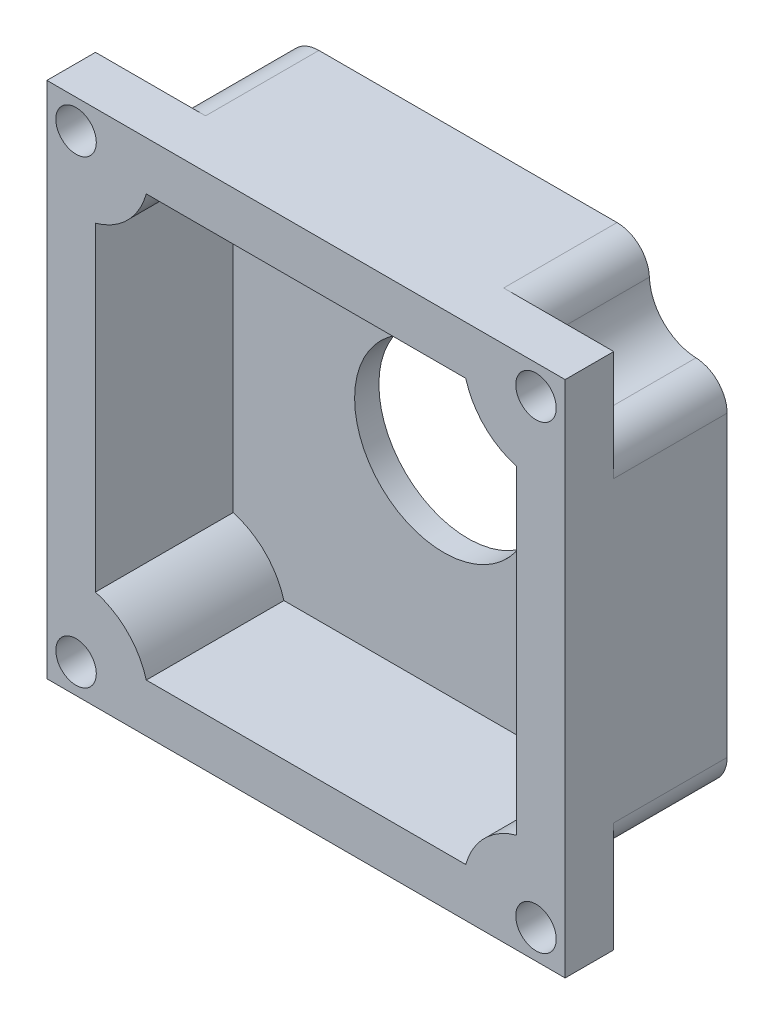
ISO-10303-21;
HEADER;
FILE_DESCRIPTION(('STEP AP214'),'2;1');
FILE_NAME('part.step','',(''),(''),'','','');
FILE_SCHEMA(('AUTOMOTIVE_DESIGN { 1 0 10303 214 1 1 1 1 }'));
ENDSEC;
DATA;
#1=APPLICATION_CONTEXT('core data for automotive mechanical design processes');
#2=APPLICATION_PROTOCOL_DEFINITION('international standard','automotive_design',2000,#1);
#3=PRODUCT_CONTEXT('',#1,'mechanical');
#4=PRODUCT('Part','Part','',(#3));
#5=PRODUCT_RELATED_PRODUCT_CATEGORY('part','',(#4));
#6=PRODUCT_DEFINITION_FORMATION('','',#4);
#7=PRODUCT_DEFINITION_CONTEXT('part definition',#1,'design');
#8=PRODUCT_DEFINITION('design','',#6,#7);
#9=PRODUCT_DEFINITION_SHAPE('','',#8);
#10=(LENGTH_UNIT() NAMED_UNIT(*) SI_UNIT(.MILLI.,.METRE.));
#11=(NAMED_UNIT(*) PLANE_ANGLE_UNIT() SI_UNIT($,.RADIAN.));
#12=(NAMED_UNIT(*) SI_UNIT($,.STERADIAN.) SOLID_ANGLE_UNIT());
#13=UNCERTAINTY_MEASURE_WITH_UNIT(LENGTH_MEASURE(1.E-05),#10,'distance_accuracy_value','');
#14=(GEOMETRIC_REPRESENTATION_CONTEXT(3) GLOBAL_UNCERTAINTY_ASSIGNED_CONTEXT((#13)) GLOBAL_UNIT_ASSIGNED_CONTEXT((#10,
#11,#12)) REPRESENTATION_CONTEXT('',''));
#15=CARTESIAN_POINT('',(0.,0.,0.));
#16=DIRECTION('',(0.,0.,1.));
#17=DIRECTION('',(1.,0.,0.));
#18=AXIS2_PLACEMENT_3D('',#15,#16,#17);
#19=CARTESIAN_POINT('',(0.,0.,1.5));
#20=DIRECTION('',(0.,0.,-1.));
#21=DIRECTION('',(-1.,0.,0.));
#22=AXIS2_PLACEMENT_3D('',#19,#20,#21);
#23=PLANE('',#22);
#24=CARTESIAN_POINT('',(0.,0.,1.5));
#25=DIRECTION('',(0.,0.,-1.));
#26=DIRECTION('',(-1.,0.,0.));
#27=AXIS2_PLACEMENT_3D('',#24,#25,#26);
#28=CIRCLE('',#27,5.5);
#29=CARTESIAN_POINT('',(-5.5,0.,1.5));
#30=VERTEX_POINT('',#29);
#31=EDGE_CURVE('E272',#30,#30,#28,.T.);
#32=ORIENTED_EDGE('',*,*,#31,.T.);
#33=EDGE_LOOP('',(#32));
#34=FACE_BOUND('',#33,.T.);
#35=CARTESIAN_POINT('',(-14.2000000000002,-14.1999999999999,1.5));
#36=DIRECTION('',(0.,0.,1.));
#37=DIRECTION('',(0.,1.,0.));
#38=AXIS2_PLACEMENT_3D('',#35,#36,#37);
#39=CIRCLE('',#38,4.5);
#40=CARTESIAN_POINT('',(-9.86295031155985,-13.,1.5));
#41=VERTEX_POINT('',#40);
#42=CARTESIAN_POINT('',(-13.,-9.86295031155958,1.5));
#43=VERTEX_POINT('',#42);
#44=EDGE_CURVE('E580',#41,#43,#39,.T.);
#45=ORIENTED_EDGE('',*,*,#44,.F.);
#46=DIRECTION('',(-1.,0.,0.));
#47=VECTOR('',#46,1.);
#48=CARTESIAN_POINT('',(13.,-13.,1.5));
#49=LINE('',#48,#47);
#50=CARTESIAN_POINT('',(9.86295031155971,-13.,1.5));
#51=VERTEX_POINT('',#50);
#52=EDGE_CURVE('E465',#51,#41,#49,.T.);
#53=ORIENTED_EDGE('',*,*,#52,.F.);
#54=CARTESIAN_POINT('',(14.2,-14.2,1.5));
#55=DIRECTION('',(0.,0.,1.));
#56=DIRECTION('',(-1.,0.,0.));
#57=AXIS2_PLACEMENT_3D('',#54,#55,#56);
#58=CIRCLE('',#57,4.5);
#59=CARTESIAN_POINT('',(13.,-9.86295031155971,1.5));
#60=VERTEX_POINT('',#59);
#61=EDGE_CURVE('E565',#60,#51,#58,.T.);
#62=ORIENTED_EDGE('',*,*,#61,.F.);
#63=DIRECTION('',(0.,-1.,0.));
#64=VECTOR('',#63,1.);
#65=CARTESIAN_POINT('',(13.,13.,1.5));
#66=LINE('',#65,#64);
#67=CARTESIAN_POINT('',(13.,9.86295031155967,1.5));
#68=VERTEX_POINT('',#67);
#69=EDGE_CURVE('E276',#68,#60,#66,.T.);
#70=ORIENTED_EDGE('',*,*,#69,.F.);
#71=CARTESIAN_POINT('',(14.2000000000001,14.2,1.5));
#72=DIRECTION('',(0.,0.,1.));
#73=DIRECTION('',(0.,-1.,0.));
#74=AXIS2_PLACEMENT_3D('',#71,#72,#73);
#75=CIRCLE('',#74,4.5);
#76=CARTESIAN_POINT('',(9.86295031155975,13.,1.5));
#77=VERTEX_POINT('',#76);
#78=EDGE_CURVE('E550',#77,#68,#75,.T.);
#79=ORIENTED_EDGE('',*,*,#78,.F.);
#80=DIRECTION('',(1.,0.,0.));
#81=VECTOR('',#80,1.);
#82=CARTESIAN_POINT('',(13.,13.,1.5));
#83=LINE('',#82,#81);
#84=CARTESIAN_POINT('',(-9.86295031155971,13.,1.5));
#85=VERTEX_POINT('',#84);
#86=EDGE_CURVE('E458',#85,#77,#83,.T.);
#87=ORIENTED_EDGE('',*,*,#86,.F.);
#88=CARTESIAN_POINT('',(-14.2,14.2,1.5));
#89=DIRECTION('',(0.,0.,1.));
#90=DIRECTION('',(1.,0.,0.));
#91=AXIS2_PLACEMENT_3D('',#88,#89,#90);
#92=CIRCLE('',#91,4.5);
#93=CARTESIAN_POINT('',(-13.,9.86295031155971,1.5));
#94=VERTEX_POINT('',#93);
#95=EDGE_CURVE('E535',#94,#85,#92,.T.);
#96=ORIENTED_EDGE('',*,*,#95,.F.);
#97=DIRECTION('',(0.,1.,0.));
#98=VECTOR('',#97,1.);
#99=CARTESIAN_POINT('',(-13.,13.,1.5));
#100=LINE('',#99,#98);
#101=EDGE_CURVE('E462',#43,#94,#100,.T.);
#102=ORIENTED_EDGE('',*,*,#101,.F.);
#103=EDGE_LOOP('',(#45,#53,#62,#70,#79,#87,#96,#102));
#104=FACE_BOUND('',#103,.T.);
#105=ADVANCED_FACE('F41',(#34,#104),#23,.F.);
#106=CARTESIAN_POINT('',(13.,-13.,10.));
#107=DIRECTION('',(0.,1.,0.));
#108=DIRECTION('',(-1.,0.,0.));
#109=AXIS2_PLACEMENT_3D('',#106,#107,#108);
#110=PLANE('',#109);
#111=ORIENTED_EDGE('',*,*,#52,.T.);
#112=DIRECTION('',(0.,0.,-1.));
#113=VECTOR('',#112,1.);
#114=CARTESIAN_POINT('',(-9.86295031155985,-12.9999999999999,10.));
#115=LINE('',#114,#113);
#116=CARTESIAN_POINT('',(-9.86295031155982,-13.,10.));
#117=VERTEX_POINT('',#116);
#118=EDGE_CURVE('E569',#117,#41,#115,.T.);
#119=ORIENTED_EDGE('',*,*,#118,.F.);
#120=DIRECTION('',(1.,0.,0.));
#121=VECTOR('',#120,1.);
#122=CARTESIAN_POINT('',(13.,-13.,10.));
#123=LINE('',#122,#121);
#124=CARTESIAN_POINT('',(9.86295031155971,-13.,10.));
#125=VERTEX_POINT('',#124);
#126=EDGE_CURVE('E455',#117,#125,#123,.T.);
#127=ORIENTED_EDGE('',*,*,#126,.T.);
#128=DIRECTION('',(0.,0.,-1.));
#129=VECTOR('',#128,1.);
#130=CARTESIAN_POINT('',(9.86295031155971,-13.,10.));
#131=LINE('',#130,#129);
#132=EDGE_CURVE('E561',#125,#51,#131,.T.);
#133=ORIENTED_EDGE('',*,*,#132,.T.);
#134=EDGE_LOOP('',(#111,#119,#127,#133));
#135=FACE_BOUND('',#134,.T.);
#136=ADVANCED_FACE('F620',(#135),#110,.T.);
#137=CARTESIAN_POINT('',(-13.,-13.,10.));
#138=DIRECTION('',(1.,0.,0.));
#139=DIRECTION('',(0.,0.,-1.));
#140=AXIS2_PLACEMENT_3D('',#137,#138,#139);
#141=PLANE('',#140);
#142=DIRECTION('',(0.,-1.,0.));
#143=VECTOR('',#142,1.);
#144=CARTESIAN_POINT('',(-13.,-13.,10.));
#145=LINE('',#144,#143);
#146=CARTESIAN_POINT('',(-13.,9.86295031155971,10.));
#147=VERTEX_POINT('',#146);
#148=CARTESIAN_POINT('',(-13.,-9.86295031155958,10.));
#149=VERTEX_POINT('',#148);
#150=EDGE_CURVE('E423',#147,#149,#145,.T.);
#151=ORIENTED_EDGE('',*,*,#150,.T.);
#152=DIRECTION('',(0.,0.,-1.));
#153=VECTOR('',#152,1.);
#154=CARTESIAN_POINT('',(-13.0000000000001,-9.86295031155958,10.));
#155=LINE('',#154,#153);
#156=EDGE_CURVE('E576',#149,#43,#155,.T.);
#157=ORIENTED_EDGE('',*,*,#156,.T.);
#158=ORIENTED_EDGE('',*,*,#101,.T.);
#159=DIRECTION('',(0.,0.,-1.));
#160=VECTOR('',#159,1.);
#161=CARTESIAN_POINT('',(-13.,9.86295031155971,10.));
#162=LINE('',#161,#160);
#163=EDGE_CURVE('E512',#147,#94,#162,.T.);
#164=ORIENTED_EDGE('',*,*,#163,.F.);
#165=EDGE_LOOP('',(#151,#157,#158,#164));
#166=FACE_BOUND('',#165,.T.);
#167=ADVANCED_FACE('F597',(#166),#141,.T.);
#168=CARTESIAN_POINT('',(13.,-13.,10.));
#169=DIRECTION('',(-1.,0.,0.));
#170=DIRECTION('',(0.,0.,1.));
#171=AXIS2_PLACEMENT_3D('',#168,#169,#170);
#172=PLANE('',#171);
#173=ORIENTED_EDGE('',*,*,#69,.T.);
#174=DIRECTION('',(0.,0.,-1.));
#175=VECTOR('',#174,1.);
#176=CARTESIAN_POINT('',(13.,-9.86295031155971,10.));
#177=LINE('',#176,#175);
#178=CARTESIAN_POINT('',(13.,-9.86295031155972,10.));
#179=VERTEX_POINT('',#178);
#180=EDGE_CURVE('E554',#179,#60,#177,.T.);
#181=ORIENTED_EDGE('',*,*,#180,.F.);
#182=DIRECTION('',(0.,1.,0.));
#183=VECTOR('',#182,1.);
#184=CARTESIAN_POINT('',(13.,-13.,10.));
#185=LINE('',#184,#183);
#186=CARTESIAN_POINT('',(13.,9.86295031155967,10.));
#187=VERTEX_POINT('',#186);
#188=EDGE_CURVE('E452',#179,#187,#185,.T.);
#189=ORIENTED_EDGE('',*,*,#188,.T.);
#190=DIRECTION('',(0.,0.,-1.));
#191=VECTOR('',#190,1.);
#192=CARTESIAN_POINT('',(13.,9.86295031155967,10.));
#193=LINE('',#192,#191);
#194=EDGE_CURVE('E546',#187,#68,#193,.T.);
#195=ORIENTED_EDGE('',*,*,#194,.T.);
#196=EDGE_LOOP('',(#173,#181,#189,#195));
#197=FACE_BOUND('',#196,.T.);
#198=ADVANCED_FACE('F614',(#197),#172,.T.);
#199=CARTESIAN_POINT('',(13.,13.,10.));
#200=DIRECTION('',(0.,-1.,0.));
#201=DIRECTION('',(1.,0.,0.));
#202=AXIS2_PLACEMENT_3D('',#199,#200,#201);
#203=PLANE('',#202);
#204=ORIENTED_EDGE('',*,*,#86,.T.);
#205=DIRECTION('',(0.,0.,-1.));
#206=VECTOR('',#205,1.);
#207=CARTESIAN_POINT('',(9.86295031155976,13.,10.));
#208=LINE('',#207,#206);
#209=CARTESIAN_POINT('',(9.86295031155975,13.,10.));
#210=VERTEX_POINT('',#209);
#211=EDGE_CURVE('E539',#210,#77,#208,.T.);
#212=ORIENTED_EDGE('',*,*,#211,.F.);
#213=DIRECTION('',(-1.,0.,0.));
#214=VECTOR('',#213,1.);
#215=CARTESIAN_POINT('',(13.,13.,10.));
#216=LINE('',#215,#214);
#217=CARTESIAN_POINT('',(-9.86295031155971,13.,10.));
#218=VERTEX_POINT('',#217);
#219=EDGE_CURVE('E449',#210,#218,#216,.T.);
#220=ORIENTED_EDGE('',*,*,#219,.T.);
#221=DIRECTION('',(0.,0.,-1.));
#222=VECTOR('',#221,1.);
#223=CARTESIAN_POINT('',(-9.86295031155971,13.,10.));
#224=LINE('',#223,#222);
#225=EDGE_CURVE('E531',#218,#85,#224,.T.);
#226=ORIENTED_EDGE('',*,*,#225,.T.);
#227=EDGE_LOOP('',(#204,#212,#220,#226));
#228=FACE_BOUND('',#227,.T.);
#229=ADVANCED_FACE('F723',(#228),#203,.T.);
#230=CARTESIAN_POINT('',(14.2,14.2,21.5));
#231=DIRECTION('',(0.,0.,-1.));
#232=DIRECTION('',(-1.,0.,0.));
#233=AXIS2_PLACEMENT_3D('',#230,#231,#232);
#234=CYLINDRICAL_SURFACE('',#233,1.25);
#235=CARTESIAN_POINT('',(14.2,14.2,10.));
#236=DIRECTION('',(0.,0.,1.));
#237=DIRECTION('',(1.,0.,0.));
#238=AXIS2_PLACEMENT_3D('',#235,#236,#237);
#239=CIRCLE('',#238,1.25);
#240=CARTESIAN_POINT('',(15.45,14.2,10.));
#241=VERTEX_POINT('',#240);
#242=EDGE_CURVE('E487',#241,#241,#239,.T.);
#243=ORIENTED_EDGE('',*,*,#242,.T.);
#244=EDGE_LOOP('',(#243));
#245=FACE_BOUND('',#244,.T.);
#246=CARTESIAN_POINT('',(14.2,14.2,7.));
#247=DIRECTION('',(0.,0.,-1.));
#248=DIRECTION('',(-1.,0.,0.));
#249=AXIS2_PLACEMENT_3D('',#246,#247,#248);
#250=CIRCLE('',#249,1.25);
#251=CARTESIAN_POINT('',(12.95,14.2,7.));
#252=VERTEX_POINT('',#251);
#253=EDGE_CURVE('E292',#252,#252,#250,.F.);
#254=ORIENTED_EDGE('',*,*,#253,.F.);
#255=EDGE_LOOP('',(#254));
#256=FACE_BOUND('',#255,.T.);
#257=ADVANCED_FACE('F721',(#245,#256),#234,.F.);
#258=CARTESIAN_POINT('',(-14.2,-14.2,21.5));
#259=DIRECTION('',(0.,0.,-1.));
#260=DIRECTION('',(-1.,0.,0.));
#261=AXIS2_PLACEMENT_3D('',#258,#259,#260);
#262=CYLINDRICAL_SURFACE('',#261,1.25);
#263=CARTESIAN_POINT('',(-14.2,-14.2,10.));
#264=DIRECTION('',(0.,0.,1.));
#265=DIRECTION('',(1.,0.,0.));
#266=AXIS2_PLACEMENT_3D('',#263,#264,#265);
#267=CIRCLE('',#266,1.25);
#268=CARTESIAN_POINT('',(-12.95,-14.2,10.));
#269=VERTEX_POINT('',#268);
#270=EDGE_CURVE('E479',#269,#269,#267,.T.);
#271=ORIENTED_EDGE('',*,*,#270,.T.);
#272=EDGE_LOOP('',(#271));
#273=FACE_BOUND('',#272,.T.);
#274=CARTESIAN_POINT('',(-14.2,-14.2,7.));
#275=DIRECTION('',(0.,0.,-1.));
#276=DIRECTION('',(-1.,0.,0.));
#277=AXIS2_PLACEMENT_3D('',#274,#275,#276);
#278=CIRCLE('',#277,1.25);
#279=CARTESIAN_POINT('',(-15.45,-14.2,7.));
#280=VERTEX_POINT('',#279);
#281=EDGE_CURVE('E253',#280,#280,#278,.F.);
#282=ORIENTED_EDGE('',*,*,#281,.F.);
#283=EDGE_LOOP('',(#282));
#284=FACE_BOUND('',#283,.T.);
#285=ADVANCED_FACE('F635',(#273,#284),#262,.F.);
#286=CARTESIAN_POINT('',(0.,0.,10.));
#287=DIRECTION('',(0.,0.,1.));
#288=DIRECTION('',(1.,0.,0.));
#289=AXIS2_PLACEMENT_3D('',#286,#287,#288);
#290=PLANE('',#289);
#291=ORIENTED_EDGE('',*,*,#126,.F.);
#292=CARTESIAN_POINT('',(-14.2000000000002,-14.1999999999999,10.));
#293=DIRECTION('',(0.,0.,1.));
#294=DIRECTION('',(0.,1.,0.));
#295=AXIS2_PLACEMENT_3D('',#292,#293,#294);
#296=CIRCLE('',#295,4.5);
#297=EDGE_CURVE('E579',#117,#149,#296,.T.);
#298=ORIENTED_EDGE('',*,*,#297,.T.);
#299=ORIENTED_EDGE('',*,*,#150,.F.);
#300=CARTESIAN_POINT('',(-14.2,14.2,10.));
#301=DIRECTION('',(0.,0.,1.));
#302=DIRECTION('',(1.,0.,0.));
#303=AXIS2_PLACEMENT_3D('',#300,#301,#302);
#304=CIRCLE('',#303,4.5);
#305=EDGE_CURVE('E534',#147,#218,#304,.T.);
#306=ORIENTED_EDGE('',*,*,#305,.T.);
#307=ORIENTED_EDGE('',*,*,#219,.F.);
#308=CARTESIAN_POINT('',(14.2000000000001,14.2,10.));
#309=DIRECTION('',(0.,0.,1.));
#310=DIRECTION('',(0.,-1.,0.));
#311=AXIS2_PLACEMENT_3D('',#308,#309,#310);
#312=CIRCLE('',#311,4.5);
#313=EDGE_CURVE('E549',#210,#187,#312,.T.);
#314=ORIENTED_EDGE('',*,*,#313,.T.);
#315=ORIENTED_EDGE('',*,*,#188,.F.);
#316=CARTESIAN_POINT('',(14.2,-14.2,10.));
#317=DIRECTION('',(0.,0.,1.));
#318=DIRECTION('',(-1.,0.,0.));
#319=AXIS2_PLACEMENT_3D('',#316,#317,#318);
#320=CIRCLE('',#319,4.5);
#321=EDGE_CURVE('E564',#179,#125,#320,.T.);
#322=ORIENTED_EDGE('',*,*,#321,.T.);
#323=EDGE_LOOP('',(#291,#298,#299,#306,#307,#314,#315,#322));
#324=FACE_BOUND('',#323,.T.);
#325=DIRECTION('',(-1.,0.,0.));
#326=VECTOR('',#325,1.);
#327=CARTESIAN_POINT('',(16.,16.,10.));
#328=LINE('',#327,#326);
#329=CARTESIAN_POINT('',(16.,16.,10.));
#330=VERTEX_POINT('',#329);
#331=CARTESIAN_POINT('',(-16.,16.,10.));
#332=VERTEX_POINT('',#331);
#333=EDGE_CURVE('E432',#330,#332,#328,.T.);
#334=ORIENTED_EDGE('',*,*,#333,.T.);
#335=DIRECTION('',(0.,-1.,0.));
#336=VECTOR('',#335,1.);
#337=CARTESIAN_POINT('',(-16.,-16.,10.));
#338=LINE('',#337,#336);
#339=CARTESIAN_POINT('',(-16.,-16.,10.));
#340=VERTEX_POINT('',#339);
#341=EDGE_CURVE('E429',#332,#340,#338,.T.);
#342=ORIENTED_EDGE('',*,*,#341,.T.);
#343=DIRECTION('',(1.,0.,0.));
#344=VECTOR('',#343,1.);
#345=CARTESIAN_POINT('',(16.,-16.,10.));
#346=LINE('',#345,#344);
#347=CARTESIAN_POINT('',(16.,-16.,10.));
#348=VERTEX_POINT('',#347);
#349=EDGE_CURVE('E440',#340,#348,#346,.T.);
#350=ORIENTED_EDGE('',*,*,#349,.T.);
#351=DIRECTION('',(0.,1.,0.));
#352=VECTOR('',#351,1.);
#353=CARTESIAN_POINT('',(16.,-16.,10.));
#354=LINE('',#353,#352);
#355=EDGE_CURVE('E257',#348,#330,#354,.T.);
#356=ORIENTED_EDGE('',*,*,#355,.T.);
#357=EDGE_LOOP('',(#334,#342,#350,#356));
#358=FACE_BOUND('',#357,.T.);
#359=CARTESIAN_POINT('',(-14.2,14.2,10.));
#360=DIRECTION('',(0.,0.,1.));
#361=DIRECTION('',(1.,0.,0.));
#362=AXIS2_PLACEMENT_3D('',#359,#360,#361);
#363=CIRCLE('',#362,1.25);
#364=CARTESIAN_POINT('',(-12.95,14.2,10.));
#365=VERTEX_POINT('',#364);
#366=EDGE_CURVE('E483',#365,#365,#363,.T.);
#367=ORIENTED_EDGE('',*,*,#366,.F.);
#368=EDGE_LOOP('',(#367));
#369=FACE_BOUND('',#368,.T.);
#370=ORIENTED_EDGE('',*,*,#270,.F.);
#371=EDGE_LOOP('',(#370));
#372=FACE_BOUND('',#371,.T.);
#373=CARTESIAN_POINT('',(14.2,-14.2,10.));
#374=DIRECTION('',(0.,0.,1.));
#375=DIRECTION('',(1.,0.,0.));
#376=AXIS2_PLACEMENT_3D('',#373,#374,#375);
#377=CIRCLE('',#376,1.25);
#378=CARTESIAN_POINT('',(15.45,-14.2,10.));
#379=VERTEX_POINT('',#378);
#380=EDGE_CURVE('E475',#379,#379,#377,.T.);
#381=ORIENTED_EDGE('',*,*,#380,.F.);
#382=EDGE_LOOP('',(#381));
#383=FACE_BOUND('',#382,.T.);
#384=ORIENTED_EDGE('',*,*,#242,.F.);
#385=EDGE_LOOP('',(#384));
#386=FACE_BOUND('',#385,.T.);
#387=ADVANCED_FACE('F591',(#324,#358,#369,#372,#383,#386),#290,.T.);
#388=CARTESIAN_POINT('',(0.,0.,0.));
#389=DIRECTION('',(0.,0.,1.));
#390=DIRECTION('',(1.,0.,0.));
#391=AXIS2_PLACEMENT_3D('',#388,#389,#390);
#392=PLANE('',#391);
#393=CARTESIAN_POINT('',(0.,0.,0.));
#394=DIRECTION('',(0.,0.,-1.));
#395=DIRECTION('',(-1.,0.,0.));
#396=AXIS2_PLACEMENT_3D('',#393,#394,#395);
#397=CIRCLE('',#396,5.5);
#398=CARTESIAN_POINT('',(-5.5,0.,0.));
#399=VERTEX_POINT('',#398);
#400=EDGE_CURVE('E277',#399,#399,#397,.T.);
#401=ORIENTED_EDGE('',*,*,#400,.F.);
#402=EDGE_LOOP('',(#401));
#403=FACE_BOUND('',#402,.T.);
#404=CARTESIAN_POINT('',(-14.2,14.2,0.));
#405=DIRECTION('',(0.,0.,-1.));
#406=DIRECTION('',(1.,0.,0.));
#407=AXIS2_PLACEMENT_3D('',#404,#405,#406);
#408=CIRCLE('',#407,3.);
#409=CARTESIAN_POINT('',(-11.2024009607688,14.08,0.));
#410=VERTEX_POINT('',#409);
#411=CARTESIAN_POINT('',(-14.08,11.2024009607688,0.));
#412=VERTEX_POINT('',#411);
#413=EDGE_CURVE('E521',#410,#412,#408,.T.);
#414=ORIENTED_EDGE('',*,*,#413,.F.);
#415=CARTESIAN_POINT('',(-9.20400160128128,14.,0.));
#416=DIRECTION('',(0.,0.,1.));
#417=DIRECTION('',(1.,0.,0.));
#418=AXIS2_PLACEMENT_3D('',#415,#416,#417);
#419=CIRCLE('',#418,2.);
#420=CARTESIAN_POINT('',(-9.20400160128128,16.,0.));
#421=VERTEX_POINT('',#420);
#422=EDGE_CURVE('E332',#410,#421,#419,.F.);
#423=ORIENTED_EDGE('',*,*,#422,.T.);
#424=DIRECTION('',(-1.,0.,0.));
#425=VECTOR('',#424,1.);
#426=CARTESIAN_POINT('',(16.,16.,0.));
#427=LINE('',#426,#425);
#428=CARTESIAN_POINT('',(9.20400160128128,16.,0.));
#429=VERTEX_POINT('',#428);
#430=EDGE_CURVE('E420',#429,#421,#427,.T.);
#431=ORIENTED_EDGE('',*,*,#430,.F.);
#432=CARTESIAN_POINT('',(9.20400160128128,14.,0.));
#433=DIRECTION('',(0.,0.,1.));
#434=DIRECTION('',(1.,0.,0.));
#435=AXIS2_PLACEMENT_3D('',#432,#433,#434);
#436=CIRCLE('',#435,2.);
#437=CARTESIAN_POINT('',(11.2024009607688,14.08,0.));
#438=VERTEX_POINT('',#437);
#439=EDGE_CURVE('E311',#429,#438,#436,.F.);
#440=ORIENTED_EDGE('',*,*,#439,.T.);
#441=CARTESIAN_POINT('',(14.2,14.2,0.));
#442=DIRECTION('',(0.,0.,-1.));
#443=DIRECTION('',(-1.,0.,0.));
#444=AXIS2_PLACEMENT_3D('',#441,#442,#443);
#445=CIRCLE('',#444,3.);
#446=CARTESIAN_POINT('',(14.08,11.2024009607688,0.));
#447=VERTEX_POINT('',#446);
#448=EDGE_CURVE('E505',#447,#438,#445,.T.);
#449=ORIENTED_EDGE('',*,*,#448,.F.);
#450=CARTESIAN_POINT('',(14.,9.20400160128129,0.));
#451=DIRECTION('',(0.,0.,1.));
#452=DIRECTION('',(1.,0.,0.));
#453=AXIS2_PLACEMENT_3D('',#450,#451,#452);
#454=CIRCLE('',#453,2.);
#455=CARTESIAN_POINT('',(16.,9.20400160128129,0.));
#456=VERTEX_POINT('',#455);
#457=EDGE_CURVE('E314',#447,#456,#454,.F.);
#458=ORIENTED_EDGE('',*,*,#457,.T.);
#459=DIRECTION('',(0.,1.,0.));
#460=VECTOR('',#459,1.);
#461=CARTESIAN_POINT('',(16.,-16.,0.));
#462=LINE('',#461,#460);
#463=CARTESIAN_POINT('',(16.,-9.20400160128129,0.));
#464=VERTEX_POINT('',#463);
#465=EDGE_CURVE('E414',#464,#456,#462,.T.);
#466=ORIENTED_EDGE('',*,*,#465,.F.);
#467=CARTESIAN_POINT('',(14.,-9.20400160128129,0.));
#468=DIRECTION('',(0.,0.,1.));
#469=DIRECTION('',(1.,0.,0.));
#470=AXIS2_PLACEMENT_3D('',#467,#468,#469);
#471=CIRCLE('',#470,2.);
#472=CARTESIAN_POINT('',(14.08,-11.2024009607688,0.));
#473=VERTEX_POINT('',#472);
#474=EDGE_CURVE('E317',#464,#473,#471,.F.);
#475=ORIENTED_EDGE('',*,*,#474,.T.);
#476=CARTESIAN_POINT('',(14.2,-14.2,0.));
#477=DIRECTION('',(0.,0.,-1.));
#478=DIRECTION('',(1.,0.,0.));
#479=AXIS2_PLACEMENT_3D('',#476,#477,#478);
#480=CIRCLE('',#479,3.);
#481=CARTESIAN_POINT('',(11.2024009607688,-14.08,0.));
#482=VERTEX_POINT('',#481);
#483=EDGE_CURVE('E403',#482,#473,#480,.T.);
#484=ORIENTED_EDGE('',*,*,#483,.F.);
#485=CARTESIAN_POINT('',(9.20400160128128,-14.,0.));
#486=DIRECTION('',(0.,0.,1.));
#487=DIRECTION('',(1.,0.,0.));
#488=AXIS2_PLACEMENT_3D('',#485,#486,#487);
#489=CIRCLE('',#488,2.);
#490=CARTESIAN_POINT('',(9.20400160128128,-16.,0.));
#491=VERTEX_POINT('',#490);
#492=EDGE_CURVE('E320',#482,#491,#489,.F.);
#493=ORIENTED_EDGE('',*,*,#492,.T.);
#494=DIRECTION('',(1.,0.,0.));
#495=VECTOR('',#494,1.);
#496=CARTESIAN_POINT('',(16.,-16.,0.));
#497=LINE('',#496,#495);
#498=CARTESIAN_POINT('',(-9.20400160128128,-16.,0.));
#499=VERTEX_POINT('',#498);
#500=EDGE_CURVE('E411',#499,#491,#497,.T.);
#501=ORIENTED_EDGE('',*,*,#500,.F.);
#502=CARTESIAN_POINT('',(-9.20400160128128,-14.,0.));
#503=DIRECTION('',(0.,0.,1.));
#504=DIRECTION('',(1.,0.,0.));
#505=AXIS2_PLACEMENT_3D('',#502,#503,#504);
#506=CIRCLE('',#505,2.);
#507=CARTESIAN_POINT('',(-11.2024009607688,-14.08,0.));
#508=VERTEX_POINT('',#507);
#509=EDGE_CURVE('E323',#499,#508,#506,.F.);
#510=ORIENTED_EDGE('',*,*,#509,.T.);
#511=CARTESIAN_POINT('',(-14.2,-14.2,0.));
#512=DIRECTION('',(0.,0.,-1.));
#513=DIRECTION('',(-1.,0.,0.));
#514=AXIS2_PLACEMENT_3D('',#511,#512,#513);
#515=CIRCLE('',#514,3.);
#516=CARTESIAN_POINT('',(-14.08,-11.2024009607688,0.));
#517=VERTEX_POINT('',#516);
#518=EDGE_CURVE('E402',#517,#508,#515,.T.);
#519=ORIENTED_EDGE('',*,*,#518,.F.);
#520=CARTESIAN_POINT('',(-14.,-9.20400160128129,0.));
#521=DIRECTION('',(0.,0.,1.));
#522=DIRECTION('',(1.,0.,0.));
#523=AXIS2_PLACEMENT_3D('',#520,#521,#522);
#524=CIRCLE('',#523,2.);
#525=CARTESIAN_POINT('',(-16.,-9.20400160128129,0.));
#526=VERTEX_POINT('',#525);
#527=EDGE_CURVE('E326',#517,#526,#524,.F.);
#528=ORIENTED_EDGE('',*,*,#527,.T.);
#529=DIRECTION('',(0.,-1.,0.));
#530=VECTOR('',#529,1.);
#531=CARTESIAN_POINT('',(-16.,-16.,0.));
#532=LINE('',#531,#530);
#533=CARTESIAN_POINT('',(-16.,9.20400160128128,0.));
#534=VERTEX_POINT('',#533);
#535=EDGE_CURVE('E415',#534,#526,#532,.T.);
#536=ORIENTED_EDGE('',*,*,#535,.F.);
#537=CARTESIAN_POINT('',(-14.,9.20400160128129,0.));
#538=DIRECTION('',(0.,0.,1.));
#539=DIRECTION('',(1.,0.,0.));
#540=AXIS2_PLACEMENT_3D('',#537,#538,#539);
#541=CIRCLE('',#540,2.);
#542=EDGE_CURVE('E329',#534,#412,#541,.F.);
#543=ORIENTED_EDGE('',*,*,#542,.T.);
#544=EDGE_LOOP('',(#414,#423,#431,#440,#449,#458,#466,#475,#484,#493,#501,#510,#519,#528,#536,#543));
#545=FACE_BOUND('',#544,.T.);
#546=ADVANCED_FACE('F410',(#403,#545),#392,.F.);
#547=CARTESIAN_POINT('',(-16.,-16.,10.));
#548=DIRECTION('',(1.,0.,0.));
#549=DIRECTION('',(0.,0.,-1.));
#550=AXIS2_PLACEMENT_3D('',#547,#548,#549);
#551=PLANE('',#550);
#552=DIRECTION('',(0.,-1.,0.));
#553=VECTOR('',#552,1.);
#554=CARTESIAN_POINT('',(-16.,-16.,7.));
#555=LINE('',#554,#553);
#556=CARTESIAN_POINT('',(-16.,16.,7.));
#557=VERTEX_POINT('',#556);
#558=CARTESIAN_POINT('',(-16.,9.20400160128128,7.));
#559=VERTEX_POINT('',#558);
#560=EDGE_CURVE('E297',#557,#559,#555,.T.);
#561=ORIENTED_EDGE('',*,*,#560,.T.);
#562=DIRECTION('',(0.,0.,-1.));
#563=VECTOR('',#562,1.);
#564=CARTESIAN_POINT('',(-16.,9.20400160128128,10.));
#565=LINE('',#564,#563);
#566=EDGE_CURVE('E339',#559,#534,#565,.T.);
#567=ORIENTED_EDGE('',*,*,#566,.T.);
#568=ORIENTED_EDGE('',*,*,#535,.T.);
#569=DIRECTION('',(0.,0.,-1.));
#570=VECTOR('',#569,1.);
#571=CARTESIAN_POINT('',(-16.,-9.20400160128129,10.));
#572=LINE('',#571,#570);
#573=CARTESIAN_POINT('',(-16.,-9.20400160128129,7.));
#574=VERTEX_POINT('',#573);
#575=EDGE_CURVE('E335',#526,#574,#572,.F.);
#576=ORIENTED_EDGE('',*,*,#575,.T.);
#577=DIRECTION('',(0.,1.,0.));
#578=VECTOR('',#577,1.);
#579=CARTESIAN_POINT('',(-16.,-16.,7.));
#580=LINE('',#579,#578);
#581=CARTESIAN_POINT('',(-16.,-16.,7.));
#582=VERTEX_POINT('',#581);
#583=EDGE_CURVE('E291',#582,#574,#580,.T.);
#584=ORIENTED_EDGE('',*,*,#583,.F.);
#585=DIRECTION('',(0.,0.,-1.));
#586=VECTOR('',#585,1.);
#587=CARTESIAN_POINT('',(-16.,-16.,10.));
#588=LINE('',#587,#586);
#589=EDGE_CURVE('E259',#340,#582,#588,.T.);
#590=ORIENTED_EDGE('',*,*,#589,.F.);
#591=ORIENTED_EDGE('',*,*,#341,.F.);
#592=DIRECTION('',(0.,0.,-1.));
#593=VECTOR('',#592,1.);
#594=CARTESIAN_POINT('',(-16.,16.,10.));
#595=LINE('',#594,#593);
#596=EDGE_CURVE('E268',#332,#557,#595,.T.);
#597=ORIENTED_EDGE('',*,*,#596,.T.);
#598=EDGE_LOOP('',(#561,#567,#568,#576,#584,#590,#591,#597));
#599=FACE_BOUND('',#598,.T.);
#600=ADVANCED_FACE('F638',(#599),#551,.F.);
#601=CARTESIAN_POINT('',(16.,-16.,10.));
#602=DIRECTION('',(0.,1.,0.));
#603=DIRECTION('',(-1.,0.,0.));
#604=AXIS2_PLACEMENT_3D('',#601,#602,#603);
#605=PLANE('',#604);
#606=DIRECTION('',(-1.,0.,0.));
#607=VECTOR('',#606,1.);
#608=CARTESIAN_POINT('',(16.,-16.,7.));
#609=LINE('',#608,#607);
#610=CARTESIAN_POINT('',(-9.20400160128128,-16.,7.));
#611=VERTEX_POINT('',#610);
#612=EDGE_CURVE('E285',#611,#582,#609,.T.);
#613=ORIENTED_EDGE('',*,*,#612,.F.);
#614=DIRECTION('',(0.,0.,-1.));
#615=VECTOR('',#614,1.);
#616=CARTESIAN_POINT('',(-9.20400160128128,-16.,10.));
#617=LINE('',#616,#615);
#618=EDGE_CURVE('E351',#611,#499,#617,.T.);
#619=ORIENTED_EDGE('',*,*,#618,.T.);
#620=ORIENTED_EDGE('',*,*,#500,.T.);
#621=DIRECTION('',(0.,0.,-1.));
#622=VECTOR('',#621,1.);
#623=CARTESIAN_POINT('',(9.20400160128128,-16.,10.));
#624=LINE('',#623,#622);
#625=CARTESIAN_POINT('',(9.20400160128128,-16.,7.));
#626=VERTEX_POINT('',#625);
#627=EDGE_CURVE('E251',#491,#626,#624,.F.);
#628=ORIENTED_EDGE('',*,*,#627,.T.);
#629=DIRECTION('',(1.,0.,0.));
#630=VECTOR('',#629,1.);
#631=CARTESIAN_POINT('',(16.,-16.,7.));
#632=LINE('',#631,#630);
#633=CARTESIAN_POINT('',(16.,-16.,7.));
#634=VERTEX_POINT('',#633);
#635=EDGE_CURVE('E230',#626,#634,#632,.T.);
#636=ORIENTED_EDGE('',*,*,#635,.T.);
#637=DIRECTION('',(0.,0.,-1.));
#638=VECTOR('',#637,1.);
#639=CARTESIAN_POINT('',(16.,-16.,10.));
#640=LINE('',#639,#638);
#641=EDGE_CURVE('E247',#348,#634,#640,.T.);
#642=ORIENTED_EDGE('',*,*,#641,.F.);
#643=ORIENTED_EDGE('',*,*,#349,.F.);
#644=ORIENTED_EDGE('',*,*,#589,.T.);
#645=EDGE_LOOP('',(#613,#619,#620,#628,#636,#642,#643,#644));
#646=FACE_BOUND('',#645,.T.);
#647=ADVANCED_FACE('F245',(#646),#605,.F.);
#648=CARTESIAN_POINT('',(16.,-16.,10.));
#649=DIRECTION('',(-1.,0.,0.));
#650=DIRECTION('',(0.,-1.,0.));
#651=AXIS2_PLACEMENT_3D('',#648,#649,#650);
#652=PLANE('',#651);
#653=DIRECTION('',(0.,1.,0.));
#654=VECTOR('',#653,1.);
#655=CARTESIAN_POINT('',(16.,-16.,7.));
#656=LINE('',#655,#654);
#657=CARTESIAN_POINT('',(16.,-9.20400160128129,7.));
#658=VERTEX_POINT('',#657);
#659=EDGE_CURVE('E226',#634,#658,#656,.T.);
#660=ORIENTED_EDGE('',*,*,#659,.T.);
#661=DIRECTION('',(0.,0.,-1.));
#662=VECTOR('',#661,1.);
#663=CARTESIAN_POINT('',(16.,-9.20400160128129,10.));
#664=LINE('',#663,#662);
#665=EDGE_CURVE('E365',#658,#464,#664,.T.);
#666=ORIENTED_EDGE('',*,*,#665,.T.);
#667=ORIENTED_EDGE('',*,*,#465,.T.);
#668=DIRECTION('',(0.,0.,-1.));
#669=VECTOR('',#668,1.);
#670=CARTESIAN_POINT('',(16.,9.20400160128129,10.));
#671=LINE('',#670,#669);
#672=CARTESIAN_POINT('',(16.,9.20400160128129,7.));
#673=VERTEX_POINT('',#672);
#674=EDGE_CURVE('E361',#456,#673,#671,.F.);
#675=ORIENTED_EDGE('',*,*,#674,.T.);
#676=DIRECTION('',(0.,-1.,0.));
#677=VECTOR('',#676,1.);
#678=CARTESIAN_POINT('',(16.,-16.,7.));
#679=LINE('',#678,#677);
#680=CARTESIAN_POINT('',(16.,16.,7.));
#681=VERTEX_POINT('',#680);
#682=EDGE_CURVE('E491',#681,#673,#679,.T.);
#683=ORIENTED_EDGE('',*,*,#682,.F.);
#684=DIRECTION('',(0.,0.,-1.));
#685=VECTOR('',#684,1.);
#686=CARTESIAN_POINT('',(16.,16.,10.));
#687=LINE('',#686,#685);
#688=EDGE_CURVE('E260',#330,#681,#687,.T.);
#689=ORIENTED_EDGE('',*,*,#688,.F.);
#690=ORIENTED_EDGE('',*,*,#355,.F.);
#691=ORIENTED_EDGE('',*,*,#641,.T.);
#692=EDGE_LOOP('',(#660,#666,#667,#675,#683,#689,#690,#691));
#693=FACE_BOUND('',#692,.T.);
#694=ADVANCED_FACE('F255',(#693),#652,.F.);
#695=CARTESIAN_POINT('',(16.,16.,10.));
#696=DIRECTION('',(0.,-1.,0.));
#697=DIRECTION('',(1.,0.,0.));
#698=AXIS2_PLACEMENT_3D('',#695,#696,#697);
#699=PLANE('',#698);
#700=ORIENTED_EDGE('',*,*,#430,.T.);
#701=DIRECTION('',(0.,0.,-1.));
#702=VECTOR('',#701,1.);
#703=CARTESIAN_POINT('',(-9.20400160128128,16.,10.));
#704=LINE('',#703,#702);
#705=CARTESIAN_POINT('',(-9.20400160128128,16.,7.));
#706=VERTEX_POINT('',#705);
#707=EDGE_CURVE('E301',#421,#706,#704,.F.);
#708=ORIENTED_EDGE('',*,*,#707,.T.);
#709=DIRECTION('',(-1.,0.,0.));
#710=VECTOR('',#709,1.);
#711=CARTESIAN_POINT('',(16.,16.,7.));
#712=LINE('',#711,#710);
#713=EDGE_CURVE('E290',#706,#557,#712,.T.);
#714=ORIENTED_EDGE('',*,*,#713,.T.);
#715=ORIENTED_EDGE('',*,*,#596,.F.);
#716=ORIENTED_EDGE('',*,*,#333,.F.);
#717=ORIENTED_EDGE('',*,*,#688,.T.);
#718=DIRECTION('',(1.,0.,0.));
#719=VECTOR('',#718,1.);
#720=CARTESIAN_POINT('',(16.,16.,7.));
#721=LINE('',#720,#719);
#722=CARTESIAN_POINT('',(9.20400160128128,16.,7.));
#723=VERTEX_POINT('',#722);
#724=EDGE_CURVE('E296',#723,#681,#721,.T.);
#725=ORIENTED_EDGE('',*,*,#724,.F.);
#726=DIRECTION('',(0.,0.,-1.));
#727=VECTOR('',#726,1.);
#728=CARTESIAN_POINT('',(9.20400160128128,16.,10.));
#729=LINE('',#728,#727);
#730=EDGE_CURVE('E265',#723,#429,#729,.T.);
#731=ORIENTED_EDGE('',*,*,#730,.T.);
#732=EDGE_LOOP('',(#700,#708,#714,#715,#716,#717,#725,#731));
#733=FACE_BOUND('',#732,.T.);
#734=ADVANCED_FACE('F640',(#733),#699,.F.);
#735=CARTESIAN_POINT('',(0.,0.,9.5));
#736=DIRECTION('',(0.,0.,-1.));
#737=DIRECTION('',(-1.,0.,0.));
#738=AXIS2_PLACEMENT_3D('',#735,#736,#737);
#739=CYLINDRICAL_SURFACE('',#738,5.5);
#740=ORIENTED_EDGE('',*,*,#400,.T.);
#741=EDGE_LOOP('',(#740));
#742=FACE_BOUND('',#741,.T.);
#743=ORIENTED_EDGE('',*,*,#31,.F.);
#744=EDGE_LOOP('',(#743));
#745=FACE_BOUND('',#744,.T.);
#746=ADVANCED_FACE('F643',(#742,#745),#739,.F.);
#747=CARTESIAN_POINT('',(-14.2,14.2,21.5));
#748=DIRECTION('',(0.,0.,-1.));
#749=DIRECTION('',(-1.,0.,0.));
#750=AXIS2_PLACEMENT_3D('',#747,#748,#749);
#751=CYLINDRICAL_SURFACE('',#750,1.25);
#752=CARTESIAN_POINT('',(-14.2,14.2,7.));
#753=DIRECTION('',(0.,0.,1.));
#754=DIRECTION('',(1.,0.,0.));
#755=AXIS2_PLACEMENT_3D('',#752,#753,#754);
#756=CIRCLE('',#755,1.25);
#757=CARTESIAN_POINT('',(-12.95,14.2,7.));
#758=VERTEX_POINT('',#757);
#759=EDGE_CURVE('E286',#758,#758,#756,.F.);
#760=ORIENTED_EDGE('',*,*,#759,.T.);
#761=EDGE_LOOP('',(#760));
#762=FACE_BOUND('',#761,.T.);
#763=ORIENTED_EDGE('',*,*,#366,.T.);
#764=EDGE_LOOP('',(#763));
#765=FACE_BOUND('',#764,.T.);
#766=ADVANCED_FACE('F736',(#762,#765),#751,.F.);
#767=CARTESIAN_POINT('',(14.2,-14.2,21.5));
#768=DIRECTION('',(0.,0.,-1.));
#769=DIRECTION('',(-1.,0.,0.));
#770=AXIS2_PLACEMENT_3D('',#767,#768,#769);
#771=CYLINDRICAL_SURFACE('',#770,1.25);
#772=CARTESIAN_POINT('',(14.2,-14.2,7.));
#773=DIRECTION('',(0.,0.,1.));
#774=DIRECTION('',(1.,0.,0.));
#775=AXIS2_PLACEMENT_3D('',#772,#773,#774);
#776=CIRCLE('',#775,1.25);
#777=CARTESIAN_POINT('',(15.45,-14.2,7.));
#778=VERTEX_POINT('',#777);
#779=EDGE_CURVE('E240',#778,#778,#776,.F.);
#780=ORIENTED_EDGE('',*,*,#779,.T.);
#781=EDGE_LOOP('',(#780));
#782=FACE_BOUND('',#781,.T.);
#783=ORIENTED_EDGE('',*,*,#380,.T.);
#784=EDGE_LOOP('',(#783));
#785=FACE_BOUND('',#784,.T.);
#786=ADVANCED_FACE('F734',(#782,#785),#771,.F.);
#787=CARTESIAN_POINT('',(14.2,-14.2,7.));
#788=DIRECTION('',(0.,0.,-1.));
#789=DIRECTION('',(-1.,0.,0.));
#790=AXIS2_PLACEMENT_3D('',#787,#788,#789);
#791=CYLINDRICAL_SURFACE('',#790,3.);
#792=CARTESIAN_POINT('',(14.2,-14.2,7.));
#793=DIRECTION('',(0.,0.,-1.));
#794=DIRECTION('',(1.,0.,0.));
#795=AXIS2_PLACEMENT_3D('',#792,#793,#794);
#796=CIRCLE('',#795,3.);
#797=CARTESIAN_POINT('',(11.2024009607688,-14.08,7.));
#798=VERTEX_POINT('',#797);
#799=CARTESIAN_POINT('',(14.08,-11.2024009607688,7.));
#800=VERTEX_POINT('',#799);
#801=EDGE_CURVE('E393',#798,#800,#796,.T.);
#802=ORIENTED_EDGE('',*,*,#801,.F.);
#803=DIRECTION('',(0.,0.,-1.));
#804=VECTOR('',#803,1.);
#805=CARTESIAN_POINT('',(11.2024009607688,-14.08,7.));
#806=LINE('',#805,#804);
#807=EDGE_CURVE('E358',#798,#482,#806,.T.);
#808=ORIENTED_EDGE('',*,*,#807,.T.);
#809=ORIENTED_EDGE('',*,*,#483,.T.);
#810=DIRECTION('',(0.,0.,-1.));
#811=VECTOR('',#810,1.);
#812=CARTESIAN_POINT('',(14.08,-11.2024009607688,7.));
#813=LINE('',#812,#811);
#814=EDGE_CURVE('E355',#473,#800,#813,.F.);
#815=ORIENTED_EDGE('',*,*,#814,.T.);
#816=EDGE_LOOP('',(#802,#808,#809,#815));
#817=FACE_BOUND('',#816,.T.);
#818=ADVANCED_FACE('F397',(#817),#791,.F.);
#819=CARTESIAN_POINT('',(14.2,-14.2,7.));
#820=DIRECTION('',(0.,0.,1.));
#821=DIRECTION('',(1.,0.,0.));
#822=AXIS2_PLACEMENT_3D('',#819,#820,#821);
#823=PLANE('',#822);
#824=ORIENTED_EDGE('',*,*,#635,.F.);
#825=CARTESIAN_POINT('',(9.20400160128128,-14.,7.));
#826=DIRECTION('',(0.,0.,1.));
#827=DIRECTION('',(1.,0.,0.));
#828=AXIS2_PLACEMENT_3D('',#825,#826,#827);
#829=CIRCLE('',#828,2.);
#830=EDGE_CURVE('E387',#626,#798,#829,.T.);
#831=ORIENTED_EDGE('',*,*,#830,.T.);
#832=ORIENTED_EDGE('',*,*,#801,.T.);
#833=CARTESIAN_POINT('',(14.,-9.20400160128129,7.));
#834=DIRECTION('',(0.,0.,1.));
#835=DIRECTION('',(1.,0.,0.));
#836=AXIS2_PLACEMENT_3D('',#833,#834,#835);
#837=CIRCLE('',#836,2.);
#838=EDGE_CURVE('E234',#800,#658,#837,.T.);
#839=ORIENTED_EDGE('',*,*,#838,.T.);
#840=ORIENTED_EDGE('',*,*,#659,.F.);
#841=EDGE_LOOP('',(#824,#831,#832,#839,#840));
#842=FACE_BOUND('',#841,.T.);
#843=ORIENTED_EDGE('',*,*,#779,.F.);
#844=EDGE_LOOP('',(#843));
#845=FACE_BOUND('',#844,.T.);
#846=ADVANCED_FACE('F228',(#842,#845),#823,.F.);
#847=CARTESIAN_POINT('',(-14.2,-14.2,7.));
#848=DIRECTION('',(0.,0.,-1.));
#849=DIRECTION('',(-1.,0.,0.));
#850=AXIS2_PLACEMENT_3D('',#847,#848,#849);
#851=CYLINDRICAL_SURFACE('',#850,3.);
#852=CARTESIAN_POINT('',(-14.2,-14.2,7.));
#853=DIRECTION('',(0.,0.,-1.));
#854=DIRECTION('',(-1.,0.,0.));
#855=AXIS2_PLACEMENT_3D('',#852,#853,#854);
#856=CIRCLE('',#855,3.);
#857=CARTESIAN_POINT('',(-14.08,-11.2024009607688,7.));
#858=VERTEX_POINT('',#857);
#859=CARTESIAN_POINT('',(-11.2024009607688,-14.08,7.));
#860=VERTEX_POINT('',#859);
#861=EDGE_CURVE('E517',#858,#860,#856,.T.);
#862=ORIENTED_EDGE('',*,*,#861,.F.);
#863=DIRECTION('',(0.,0.,-1.));
#864=VECTOR('',#863,1.);
#865=CARTESIAN_POINT('',(-14.08,-11.2024009607688,7.));
#866=LINE('',#865,#864);
#867=EDGE_CURVE('E346',#858,#517,#866,.T.);
#868=ORIENTED_EDGE('',*,*,#867,.T.);
#869=ORIENTED_EDGE('',*,*,#518,.T.);
#870=DIRECTION('',(0.,0.,-1.));
#871=VECTOR('',#870,1.);
#872=CARTESIAN_POINT('',(-11.2024009607688,-14.08,7.));
#873=LINE('',#872,#871);
#874=EDGE_CURVE('E343',#508,#860,#873,.F.);
#875=ORIENTED_EDGE('',*,*,#874,.T.);
#876=EDGE_LOOP('',(#862,#868,#869,#875));
#877=FACE_BOUND('',#876,.T.);
#878=ADVANCED_FACE('F696',(#877),#851,.F.);
#879=CARTESIAN_POINT('',(-14.2,-14.2,7.));
#880=DIRECTION('',(0.,0.,-1.));
#881=DIRECTION('',(-1.,0.,0.));
#882=AXIS2_PLACEMENT_3D('',#879,#880,#881);
#883=PLANE('',#882);
#884=ORIENTED_EDGE('',*,*,#281,.T.);
#885=EDGE_LOOP('',(#884));
#886=FACE_BOUND('',#885,.T.);
#887=ORIENTED_EDGE('',*,*,#583,.T.);
#888=CARTESIAN_POINT('',(-14.,-9.20400160128129,7.));
#889=DIRECTION('',(0.,0.,-1.));
#890=DIRECTION('',(-1.,0.,0.));
#891=AXIS2_PLACEMENT_3D('',#888,#889,#890);
#892=CIRCLE('',#891,2.);
#893=EDGE_CURVE('E380',#574,#858,#892,.F.);
#894=ORIENTED_EDGE('',*,*,#893,.T.);
#895=ORIENTED_EDGE('',*,*,#861,.T.);
#896=CARTESIAN_POINT('',(-9.20400160128128,-14.,7.));
#897=DIRECTION('',(0.,0.,-1.));
#898=DIRECTION('',(-1.,0.,0.));
#899=AXIS2_PLACEMENT_3D('',#896,#897,#898);
#900=CIRCLE('',#899,2.);
#901=EDGE_CURVE('E383',#860,#611,#900,.F.);
#902=ORIENTED_EDGE('',*,*,#901,.T.);
#903=ORIENTED_EDGE('',*,*,#612,.T.);
#904=EDGE_LOOP('',(#887,#894,#895,#902,#903));
#905=FACE_BOUND('',#904,.T.);
#906=ADVANCED_FACE('F690',(#886,#905),#883,.T.);
#907=CARTESIAN_POINT('',(-14.2,14.2,7.));
#908=DIRECTION('',(0.,0.,-1.));
#909=DIRECTION('',(-1.,0.,0.));
#910=AXIS2_PLACEMENT_3D('',#907,#908,#909);
#911=CYLINDRICAL_SURFACE('',#910,3.);
#912=CARTESIAN_POINT('',(-14.2,14.2,7.));
#913=DIRECTION('',(0.,0.,-1.));
#914=DIRECTION('',(1.,0.,0.));
#915=AXIS2_PLACEMENT_3D('',#912,#913,#914);
#916=CIRCLE('',#915,3.);
#917=CARTESIAN_POINT('',(-11.2024009607688,14.08,7.));
#918=VERTEX_POINT('',#917);
#919=CARTESIAN_POINT('',(-14.08,11.2024009607688,7.));
#920=VERTEX_POINT('',#919);
#921=EDGE_CURVE('E508',#918,#920,#916,.T.);
#922=ORIENTED_EDGE('',*,*,#921,.F.);
#923=DIRECTION('',(0.,0.,-1.));
#924=VECTOR('',#923,1.);
#925=CARTESIAN_POINT('',(-11.2024009607688,14.08,7.));
#926=LINE('',#925,#924);
#927=EDGE_CURVE('E308',#918,#410,#926,.T.);
#928=ORIENTED_EDGE('',*,*,#927,.T.);
#929=ORIENTED_EDGE('',*,*,#413,.T.);
#930=DIRECTION('',(0.,0.,-1.));
#931=VECTOR('',#930,1.);
#932=CARTESIAN_POINT('',(-14.08,11.2024009607688,7.));
#933=LINE('',#932,#931);
#934=EDGE_CURVE('E305',#412,#920,#933,.F.);
#935=ORIENTED_EDGE('',*,*,#934,.T.);
#936=EDGE_LOOP('',(#922,#928,#929,#935));
#937=FACE_BOUND('',#936,.T.);
#938=ADVANCED_FACE('F707',(#937),#911,.F.);
#939=CARTESIAN_POINT('',(-14.2,14.2,7.));
#940=DIRECTION('',(0.,0.,1.));
#941=DIRECTION('',(1.,0.,0.));
#942=AXIS2_PLACEMENT_3D('',#939,#940,#941);
#943=PLANE('',#942);
#944=ORIENTED_EDGE('',*,*,#713,.F.);
#945=CARTESIAN_POINT('',(-9.20400160128128,14.,7.));
#946=DIRECTION('',(0.,0.,1.));
#947=DIRECTION('',(1.,0.,0.));
#948=AXIS2_PLACEMENT_3D('',#945,#946,#947);
#949=CIRCLE('',#948,2.);
#950=EDGE_CURVE('E373',#706,#918,#949,.T.);
#951=ORIENTED_EDGE('',*,*,#950,.T.);
#952=ORIENTED_EDGE('',*,*,#921,.T.);
#953=CARTESIAN_POINT('',(-14.,9.20400160128129,7.));
#954=DIRECTION('',(0.,0.,1.));
#955=DIRECTION('',(1.,0.,0.));
#956=AXIS2_PLACEMENT_3D('',#953,#954,#955);
#957=CIRCLE('',#956,2.);
#958=EDGE_CURVE('E376',#920,#559,#957,.T.);
#959=ORIENTED_EDGE('',*,*,#958,.T.);
#960=ORIENTED_EDGE('',*,*,#560,.F.);
#961=EDGE_LOOP('',(#944,#951,#952,#959,#960));
#962=FACE_BOUND('',#961,.T.);
#963=ORIENTED_EDGE('',*,*,#759,.F.);
#964=EDGE_LOOP('',(#963));
#965=FACE_BOUND('',#964,.T.);
#966=ADVANCED_FACE('F753',(#962,#965),#943,.F.);
#967=CARTESIAN_POINT('',(14.2,14.2,7.));
#968=DIRECTION('',(0.,0.,-1.));
#969=DIRECTION('',(-1.,0.,0.));
#970=AXIS2_PLACEMENT_3D('',#967,#968,#969);
#971=CYLINDRICAL_SURFACE('',#970,3.);
#972=CARTESIAN_POINT('',(14.2,14.2,7.));
#973=DIRECTION('',(0.,0.,-1.));
#974=DIRECTION('',(-1.,0.,0.));
#975=AXIS2_PLACEMENT_3D('',#972,#973,#974);
#976=CIRCLE('',#975,3.);
#977=CARTESIAN_POINT('',(14.08,11.2024009607688,7.));
#978=VERTEX_POINT('',#977);
#979=CARTESIAN_POINT('',(11.2024009607688,14.08,7.));
#980=VERTEX_POINT('',#979);
#981=EDGE_CURVE('E281',#978,#980,#976,.T.);
#982=ORIENTED_EDGE('',*,*,#981,.F.);
#983=DIRECTION('',(0.,0.,-1.));
#984=VECTOR('',#983,1.);
#985=CARTESIAN_POINT('',(14.08,11.2024009607688,7.));
#986=LINE('',#985,#984);
#987=EDGE_CURVE('E370',#978,#447,#986,.T.);
#988=ORIENTED_EDGE('',*,*,#987,.T.);
#989=ORIENTED_EDGE('',*,*,#448,.T.);
#990=DIRECTION('',(0.,0.,-1.));
#991=VECTOR('',#990,1.);
#992=CARTESIAN_POINT('',(11.2024009607688,14.08,7.));
#993=LINE('',#992,#991);
#994=EDGE_CURVE('E57',#438,#980,#993,.F.);
#995=ORIENTED_EDGE('',*,*,#994,.T.);
#996=EDGE_LOOP('',(#982,#988,#989,#995));
#997=FACE_BOUND('',#996,.T.);
#998=ADVANCED_FACE('F714',(#997),#971,.F.);
#999=CARTESIAN_POINT('',(14.2,14.2,7.));
#1000=DIRECTION('',(0.,0.,-1.));
#1001=DIRECTION('',(-1.,0.,0.));
#1002=AXIS2_PLACEMENT_3D('',#999,#1000,#1001);
#1003=PLANE('',#1002);
#1004=ORIENTED_EDGE('',*,*,#682,.T.);
#1005=CARTESIAN_POINT('',(14.,9.20400160128129,7.));
#1006=DIRECTION('',(0.,0.,-1.));
#1007=DIRECTION('',(-1.,0.,0.));
#1008=AXIS2_PLACEMENT_3D('',#1005,#1006,#1007);
#1009=CIRCLE('',#1008,2.);
#1010=EDGE_CURVE('E50',#673,#978,#1009,.F.);
#1011=ORIENTED_EDGE('',*,*,#1010,.T.);
#1012=ORIENTED_EDGE('',*,*,#981,.T.);
#1013=CARTESIAN_POINT('',(9.20400160128128,14.,7.));
#1014=DIRECTION('',(0.,0.,-1.));
#1015=DIRECTION('',(-1.,0.,0.));
#1016=AXIS2_PLACEMENT_3D('',#1013,#1014,#1015);
#1017=CIRCLE('',#1016,2.);
#1018=EDGE_CURVE('E11',#980,#723,#1017,.F.);
#1019=ORIENTED_EDGE('',*,*,#1018,.T.);
#1020=ORIENTED_EDGE('',*,*,#724,.T.);
#1021=EDGE_LOOP('',(#1004,#1011,#1012,#1019,#1020));
#1022=FACE_BOUND('',#1021,.T.);
#1023=ORIENTED_EDGE('',*,*,#253,.T.);
#1024=EDGE_LOOP('',(#1023));
#1025=FACE_BOUND('',#1024,.T.);
#1026=ADVANCED_FACE('F715',(#1022,#1025),#1003,.T.);
#1027=CARTESIAN_POINT('',(-14.2,14.2,10.));
#1028=DIRECTION('',(0.,0.,-1.));
#1029=DIRECTION('',(-1.,0.,0.));
#1030=AXIS2_PLACEMENT_3D('',#1027,#1028,#1029);
#1031=CYLINDRICAL_SURFACE('',#1030,4.5);
#1032=ORIENTED_EDGE('',*,*,#95,.T.);
#1033=ORIENTED_EDGE('',*,*,#225,.F.);
#1034=ORIENTED_EDGE('',*,*,#305,.F.);
#1035=ORIENTED_EDGE('',*,*,#163,.T.);
#1036=EDGE_LOOP('',(#1032,#1033,#1034,#1035));
#1037=FACE_BOUND('',#1036,.T.);
#1038=ADVANCED_FACE('F604',(#1037),#1031,.T.);
#1039=CARTESIAN_POINT('',(14.2000000000001,14.2,10.));
#1040=DIRECTION('',(0.,0.,-1.));
#1041=DIRECTION('',(-1.,0.,0.));
#1042=AXIS2_PLACEMENT_3D('',#1039,#1040,#1041);
#1043=CYLINDRICAL_SURFACE('',#1042,4.5);
#1044=ORIENTED_EDGE('',*,*,#78,.T.);
#1045=ORIENTED_EDGE('',*,*,#194,.F.);
#1046=ORIENTED_EDGE('',*,*,#313,.F.);
#1047=ORIENTED_EDGE('',*,*,#211,.T.);
#1048=EDGE_LOOP('',(#1044,#1045,#1046,#1047));
#1049=FACE_BOUND('',#1048,.T.);
#1050=ADVANCED_FACE('F611',(#1049),#1043,.T.);
#1051=CARTESIAN_POINT('',(14.2,-14.2,10.));
#1052=DIRECTION('',(0.,0.,-1.));
#1053=DIRECTION('',(-1.,0.,0.));
#1054=AXIS2_PLACEMENT_3D('',#1051,#1052,#1053);
#1055=CYLINDRICAL_SURFACE('',#1054,4.5);
#1056=ORIENTED_EDGE('',*,*,#61,.T.);
#1057=ORIENTED_EDGE('',*,*,#132,.F.);
#1058=ORIENTED_EDGE('',*,*,#321,.F.);
#1059=ORIENTED_EDGE('',*,*,#180,.T.);
#1060=EDGE_LOOP('',(#1056,#1057,#1058,#1059));
#1061=FACE_BOUND('',#1060,.T.);
#1062=ADVANCED_FACE('F617',(#1061),#1055,.T.);
#1063=CARTESIAN_POINT('',(-14.2000000000002,-14.1999999999999,10.));
#1064=DIRECTION('',(0.,0.,-1.));
#1065=DIRECTION('',(-1.,0.,0.));
#1066=AXIS2_PLACEMENT_3D('',#1063,#1064,#1065);
#1067=CYLINDRICAL_SURFACE('',#1066,4.5);
#1068=ORIENTED_EDGE('',*,*,#44,.T.);
#1069=ORIENTED_EDGE('',*,*,#156,.F.);
#1070=ORIENTED_EDGE('',*,*,#297,.F.);
#1071=ORIENTED_EDGE('',*,*,#118,.T.);
#1072=EDGE_LOOP('',(#1068,#1069,#1070,#1071));
#1073=FACE_BOUND('',#1072,.T.);
#1074=ADVANCED_FACE('F594',(#1073),#1067,.T.);
#1075=CARTESIAN_POINT('',(-9.20400160128128,14.,7.));
#1076=DIRECTION('',(0.,0.,-1.));
#1077=DIRECTION('',(-1.,0.,0.));
#1078=AXIS2_PLACEMENT_3D('',#1075,#1076,#1077);
#1079=CYLINDRICAL_SURFACE('',#1078,2.);
#1080=ORIENTED_EDGE('',*,*,#422,.F.);
#1081=ORIENTED_EDGE('',*,*,#927,.F.);
#1082=ORIENTED_EDGE('',*,*,#950,.F.);
#1083=ORIENTED_EDGE('',*,*,#707,.F.);
#1084=EDGE_LOOP('',(#1080,#1081,#1082,#1083));
#1085=FACE_BOUND('',#1084,.T.);
#1086=ADVANCED_FACE('F651',(#1085),#1079,.T.);
#1087=CARTESIAN_POINT('',(-14.,9.20400160128129,7.));
#1088=DIRECTION('',(0.,0.,-1.));
#1089=DIRECTION('',(-1.,0.,0.));
#1090=AXIS2_PLACEMENT_3D('',#1087,#1088,#1089);
#1091=CYLINDRICAL_SURFACE('',#1090,2.);
#1092=ORIENTED_EDGE('',*,*,#958,.F.);
#1093=ORIENTED_EDGE('',*,*,#934,.F.);
#1094=ORIENTED_EDGE('',*,*,#542,.F.);
#1095=ORIENTED_EDGE('',*,*,#566,.F.);
#1096=EDGE_LOOP('',(#1092,#1093,#1094,#1095));
#1097=FACE_BOUND('',#1096,.T.);
#1098=ADVANCED_FACE('F654',(#1097),#1091,.T.);
#1099=CARTESIAN_POINT('',(-14.,-9.20400160128129,7.));
#1100=DIRECTION('',(0.,0.,-1.));
#1101=DIRECTION('',(-1.,0.,0.));
#1102=AXIS2_PLACEMENT_3D('',#1099,#1100,#1101);
#1103=CYLINDRICAL_SURFACE('',#1102,2.);
#1104=ORIENTED_EDGE('',*,*,#527,.F.);
#1105=ORIENTED_EDGE('',*,*,#867,.F.);
#1106=ORIENTED_EDGE('',*,*,#893,.F.);
#1107=ORIENTED_EDGE('',*,*,#575,.F.);
#1108=EDGE_LOOP('',(#1104,#1105,#1106,#1107));
#1109=FACE_BOUND('',#1108,.T.);
#1110=ADVANCED_FACE('F658',(#1109),#1103,.T.);
#1111=CARTESIAN_POINT('',(-9.20400160128128,-14.,7.));
#1112=DIRECTION('',(0.,0.,-1.));
#1113=DIRECTION('',(-1.,0.,0.));
#1114=AXIS2_PLACEMENT_3D('',#1111,#1112,#1113);
#1115=CYLINDRICAL_SURFACE('',#1114,2.);
#1116=ORIENTED_EDGE('',*,*,#901,.F.);
#1117=ORIENTED_EDGE('',*,*,#874,.F.);
#1118=ORIENTED_EDGE('',*,*,#509,.F.);
#1119=ORIENTED_EDGE('',*,*,#618,.F.);
#1120=EDGE_LOOP('',(#1116,#1117,#1118,#1119));
#1121=FACE_BOUND('',#1120,.T.);
#1122=ADVANCED_FACE('F662',(#1121),#1115,.T.);
#1123=CARTESIAN_POINT('',(9.20400160128128,-14.,7.));
#1124=DIRECTION('',(0.,0.,-1.));
#1125=DIRECTION('',(-1.,0.,0.));
#1126=AXIS2_PLACEMENT_3D('',#1123,#1124,#1125);
#1127=CYLINDRICAL_SURFACE('',#1126,2.);
#1128=ORIENTED_EDGE('',*,*,#492,.F.);
#1129=ORIENTED_EDGE('',*,*,#807,.F.);
#1130=ORIENTED_EDGE('',*,*,#830,.F.);
#1131=ORIENTED_EDGE('',*,*,#627,.F.);
#1132=EDGE_LOOP('',(#1128,#1129,#1130,#1131));
#1133=FACE_BOUND('',#1132,.T.);
#1134=ADVANCED_FACE('F406',(#1133),#1127,.T.);
#1135=CARTESIAN_POINT('',(14.,-9.20400160128129,7.));
#1136=DIRECTION('',(0.,0.,-1.));
#1137=DIRECTION('',(-1.,0.,0.));
#1138=AXIS2_PLACEMENT_3D('',#1135,#1136,#1137);
#1139=CYLINDRICAL_SURFACE('',#1138,2.);
#1140=ORIENTED_EDGE('',*,*,#838,.F.);
#1141=ORIENTED_EDGE('',*,*,#814,.F.);
#1142=ORIENTED_EDGE('',*,*,#474,.F.);
#1143=ORIENTED_EDGE('',*,*,#665,.F.);
#1144=EDGE_LOOP('',(#1140,#1141,#1142,#1143));
#1145=FACE_BOUND('',#1144,.T.);
#1146=ADVANCED_FACE('F669',(#1145),#1139,.T.);
#1147=CARTESIAN_POINT('',(14.,9.20400160128129,7.));
#1148=DIRECTION('',(0.,0.,-1.));
#1149=DIRECTION('',(-1.,0.,0.));
#1150=AXIS2_PLACEMENT_3D('',#1147,#1148,#1149);
#1151=CYLINDRICAL_SURFACE('',#1150,2.);
#1152=ORIENTED_EDGE('',*,*,#457,.F.);
#1153=ORIENTED_EDGE('',*,*,#987,.F.);
#1154=ORIENTED_EDGE('',*,*,#1010,.F.);
#1155=ORIENTED_EDGE('',*,*,#674,.F.);
#1156=EDGE_LOOP('',(#1152,#1153,#1154,#1155));
#1157=FACE_BOUND('',#1156,.T.);
#1158=ADVANCED_FACE('F671',(#1157),#1151,.T.);
#1159=CARTESIAN_POINT('',(9.20400160128128,14.,7.));
#1160=DIRECTION('',(0.,0.,-1.));
#1161=DIRECTION('',(-1.,0.,0.));
#1162=AXIS2_PLACEMENT_3D('',#1159,#1160,#1161);
#1163=CYLINDRICAL_SURFACE('',#1162,2.);
#1164=ORIENTED_EDGE('',*,*,#1018,.F.);
#1165=ORIENTED_EDGE('',*,*,#994,.F.);
#1166=ORIENTED_EDGE('',*,*,#439,.F.);
#1167=ORIENTED_EDGE('',*,*,#730,.F.);
#1168=EDGE_LOOP('',(#1164,#1165,#1166,#1167));
#1169=FACE_BOUND('',#1168,.T.);
#1170=ADVANCED_FACE('F43',(#1169),#1163,.T.);
#1171=CLOSED_SHELL('',(#105,#136,#167,#198,#229,#257,#285,#387,#546,#600,#647,#694,#734,#746,
#766,#786,#818,#846,#878,#906,#938,#966,#998,#1026,#1038,#1050,#1062,#1074,#1086,#1098,#1110,
#1122,#1134,#1146,#1158,#1170));
#1172=MANIFOLD_SOLID_BREP('B2',#1171);
#1173=ADVANCED_BREP_SHAPE_REPRESENTATION('',(#18,#1172),#14);
#1174=SHAPE_DEFINITION_REPRESENTATION(#9,#1173);
ENDSEC;
END-ISO-10303-21;
